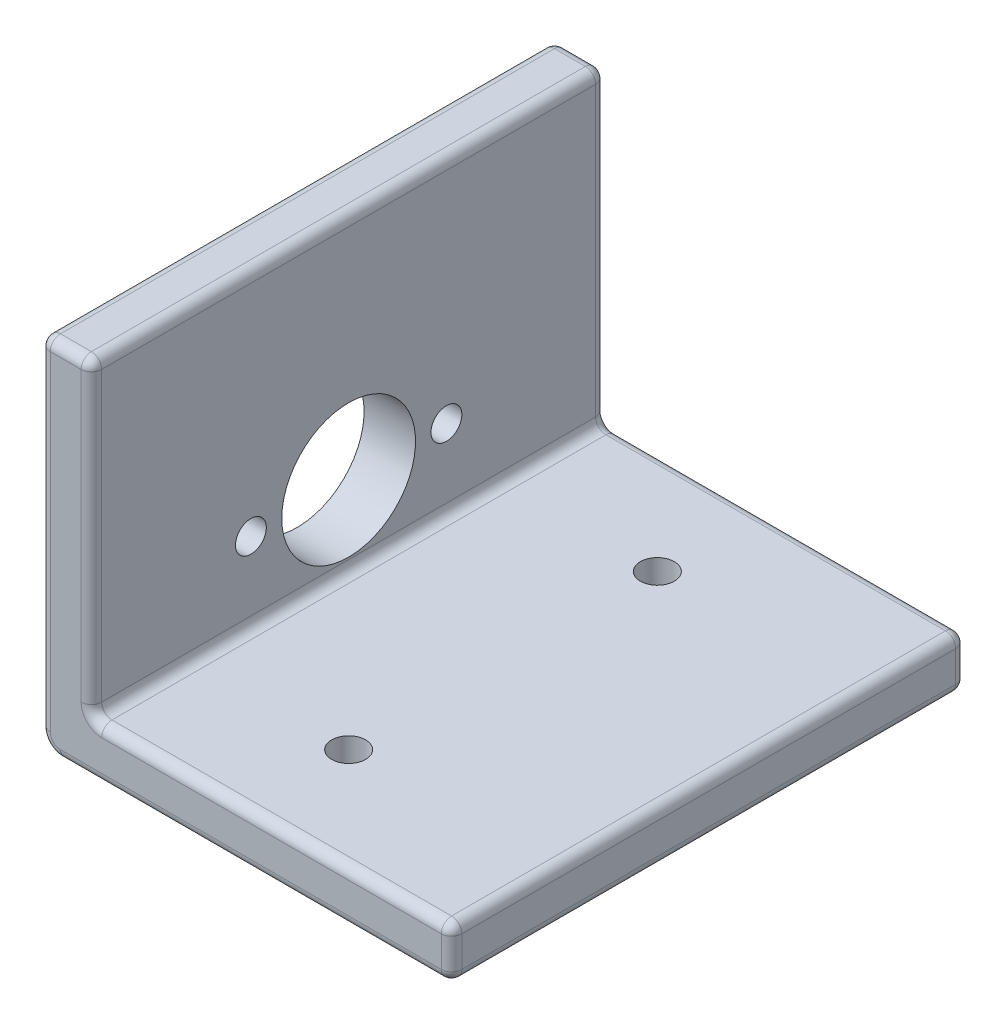
ISO-10303-21;
HEADER;
FILE_DESCRIPTION(('STEP AP214'),'2;1');
FILE_NAME('part.step','',(''),(''),'','','');
FILE_SCHEMA(('AUTOMOTIVE_DESIGN { 1 0 10303 214 1 1 1 1 }'));
ENDSEC;
DATA;
#1=APPLICATION_CONTEXT('core data for automotive mechanical design processes');
#2=APPLICATION_PROTOCOL_DEFINITION('international standard','automotive_design',2000,#1);
#3=PRODUCT_CONTEXT('',#1,'mechanical');
#4=PRODUCT('Part','Part','',(#3));
#5=PRODUCT_RELATED_PRODUCT_CATEGORY('part','',(#4));
#6=PRODUCT_DEFINITION_FORMATION('','',#4);
#7=PRODUCT_DEFINITION_CONTEXT('part definition',#1,'design');
#8=PRODUCT_DEFINITION('design','',#6,#7);
#9=PRODUCT_DEFINITION_SHAPE('','',#8);
#10=(LENGTH_UNIT() NAMED_UNIT(*) SI_UNIT(.MILLI.,.METRE.));
#11=(NAMED_UNIT(*) PLANE_ANGLE_UNIT() SI_UNIT($,.RADIAN.));
#12=(NAMED_UNIT(*) SI_UNIT($,.STERADIAN.) SOLID_ANGLE_UNIT());
#13=UNCERTAINTY_MEASURE_WITH_UNIT(LENGTH_MEASURE(1.E-05),#10,'distance_accuracy_value','');
#14=(GEOMETRIC_REPRESENTATION_CONTEXT(3) GLOBAL_UNCERTAINTY_ASSIGNED_CONTEXT((#13)) GLOBAL_UNIT_ASSIGNED_CONTEXT((#10,
#11,#12)) REPRESENTATION_CONTEXT('',''));
#15=CARTESIAN_POINT('',(0.,0.,0.));
#16=DIRECTION('',(0.,0.,1.));
#17=DIRECTION('',(1.,0.,0.));
#18=AXIS2_PLACEMENT_3D('',#15,#16,#17);
#19=CARTESIAN_POINT('',(0.,0.,50.));
#20=DIRECTION('',(0.,1.,0.));
#21=DIRECTION('',(0.,0.,1.));
#22=AXIS2_PLACEMENT_3D('',#19,#20,#21);
#23=PLANE('',#22);
#24=DIRECTION('',(0.,0.,-1.));
#25=VECTOR('',#24,1.);
#26=CARTESIAN_POINT('',(2.,0.,50.));
#27=LINE('',#26,#25);
#28=CARTESIAN_POINT('',(2.,0.,49.));
#29=VERTEX_POINT('',#28);
#30=CARTESIAN_POINT('',(2.,0.,1.));
#31=VERTEX_POINT('',#30);
#32=EDGE_CURVE('E176',#29,#31,#27,.T.);
#33=ORIENTED_EDGE('',*,*,#32,.T.);
#34=DIRECTION('',(1.,0.,0.));
#35=VECTOR('',#34,1.);
#36=CARTESIAN_POINT('',(0.,0.,1.));
#37=LINE('',#36,#35);
#38=CARTESIAN_POINT('',(39.,0.,1.));
#39=VERTEX_POINT('',#38);
#40=EDGE_CURVE('E184',#31,#39,#37,.T.);
#41=ORIENTED_EDGE('',*,*,#40,.T.);
#42=DIRECTION('',(0.,0.,-1.));
#43=VECTOR('',#42,1.);
#44=CARTESIAN_POINT('',(39.,0.,50.));
#45=LINE('',#44,#43);
#46=CARTESIAN_POINT('',(39.,0.,49.));
#47=VERTEX_POINT('',#46);
#48=EDGE_CURVE('E179',#39,#47,#45,.F.);
#49=ORIENTED_EDGE('',*,*,#48,.T.);
#50=DIRECTION('',(1.,0.,0.));
#51=VECTOR('',#50,1.);
#52=CARTESIAN_POINT('',(2.,0.,49.));
#53=LINE('',#52,#51);
#54=EDGE_CURVE('E172',#47,#29,#53,.F.);
#55=ORIENTED_EDGE('',*,*,#54,.T.);
#56=EDGE_LOOP('',(#33,#41,#49,#55));
#57=FACE_BOUND('',#56,.T.);
#58=CARTESIAN_POINT('',(20.,0.,10.));
#59=DIRECTION('',(0.,1.,0.));
#60=DIRECTION('',(0.,0.,1.));
#61=AXIS2_PLACEMENT_3D('',#58,#59,#60);
#62=CIRCLE('',#61,1.64999999999994);
#63=CARTESIAN_POINT('',(20.,0.,11.65));
#64=VERTEX_POINT('',#63);
#65=EDGE_CURVE('E274',#64,#64,#62,.T.);
#66=ORIENTED_EDGE('',*,*,#65,.T.);
#67=EDGE_LOOP('',(#66));
#68=FACE_BOUND('',#67,.T.);
#69=CARTESIAN_POINT('',(20.,0.,40.));
#70=DIRECTION('',(0.,1.,0.));
#71=DIRECTION('',(0.,0.,1.));
#72=AXIS2_PLACEMENT_3D('',#69,#70,#71);
#73=CIRCLE('',#72,1.64999999999994);
#74=CARTESIAN_POINT('',(20.,0.,41.6499999999999));
#75=VERTEX_POINT('',#74);
#76=EDGE_CURVE('E264',#75,#75,#73,.F.);
#77=ORIENTED_EDGE('',*,*,#76,.F.);
#78=EDGE_LOOP('',(#77));
#79=FACE_BOUND('',#78,.T.);
#80=ADVANCED_FACE('F32',(#57,#68,#79),#23,.F.);
#81=CARTESIAN_POINT('',(5.,5.,50.));
#82=DIRECTION('',(0.,-1.,0.));
#83=DIRECTION('',(0.,0.,-1.));
#84=AXIS2_PLACEMENT_3D('',#81,#82,#83);
#85=PLANE('',#84);
#86=DIRECTION('',(0.,0.,-1.));
#87=VECTOR('',#86,1.);
#88=CARTESIAN_POINT('',(39.,5.,50.));
#89=LINE('',#88,#87);
#90=CARTESIAN_POINT('',(39.,5.,49.));
#91=VERTEX_POINT('',#90);
#92=CARTESIAN_POINT('',(39.,5.,1.));
#93=VERTEX_POINT('',#92);
#94=EDGE_CURVE('E320',#91,#93,#89,.T.);
#95=ORIENTED_EDGE('',*,*,#94,.T.);
#96=DIRECTION('',(-1.,0.,0.));
#97=VECTOR('',#96,1.);
#98=CARTESIAN_POINT('',(5.,5.,1.));
#99=LINE('',#98,#97);
#100=CARTESIAN_POINT('',(6.,5.,1.));
#101=VERTEX_POINT('',#100);
#102=EDGE_CURVE('E324',#93,#101,#99,.T.);
#103=ORIENTED_EDGE('',*,*,#102,.T.);
#104=DIRECTION('',(0.,0.,-1.));
#105=VECTOR('',#104,1.);
#106=CARTESIAN_POINT('',(6.,5.,50.));
#107=LINE('',#106,#105);
#108=CARTESIAN_POINT('',(6.,5.,49.));
#109=VERTEX_POINT('',#108);
#110=EDGE_CURVE('E298',#101,#109,#107,.F.);
#111=ORIENTED_EDGE('',*,*,#110,.T.);
#112=DIRECTION('',(-1.,0.,0.));
#113=VECTOR('',#112,1.);
#114=CARTESIAN_POINT('',(40.,5.,49.));
#115=LINE('',#114,#113);
#116=EDGE_CURVE('E322',#109,#91,#115,.F.);
#117=ORIENTED_EDGE('',*,*,#116,.T.);
#118=EDGE_LOOP('',(#95,#103,#111,#117));
#119=FACE_BOUND('',#118,.T.);
#120=CARTESIAN_POINT('',(20.,5.,10.));
#121=DIRECTION('',(0.,1.,0.));
#122=DIRECTION('',(0.,0.,1.));
#123=AXIS2_PLACEMENT_3D('',#120,#121,#122);
#124=CIRCLE('',#123,1.64999999999994);
#125=CARTESIAN_POINT('',(20.,5.,11.65));
#126=VERTEX_POINT('',#125);
#127=EDGE_CURVE('E269',#126,#126,#124,.T.);
#128=ORIENTED_EDGE('',*,*,#127,.F.);
#129=EDGE_LOOP('',(#128));
#130=FACE_BOUND('',#129,.T.);
#131=CARTESIAN_POINT('',(20.,5.,40.));
#132=DIRECTION('',(0.,1.,0.));
#133=DIRECTION('',(0.,0.,1.));
#134=AXIS2_PLACEMENT_3D('',#131,#132,#133);
#135=CIRCLE('',#134,1.64999999999994);
#136=CARTESIAN_POINT('',(20.,5.,41.6499999999999));
#137=VERTEX_POINT('',#136);
#138=EDGE_CURVE('E258',#137,#137,#135,.F.);
#139=ORIENTED_EDGE('',*,*,#138,.T.);
#140=EDGE_LOOP('',(#139));
#141=FACE_BOUND('',#140,.T.);
#142=ADVANCED_FACE('F444',(#119,#130,#141),#85,.F.);
#143=CARTESIAN_POINT('',(40.,0.,50.));
#144=DIRECTION('',(-1.,0.,0.));
#145=DIRECTION('',(0.,0.,1.));
#146=AXIS2_PLACEMENT_3D('',#143,#144,#145);
#147=PLANE('',#146);
#148=DIRECTION('',(0.,0.,-1.));
#149=VECTOR('',#148,1.);
#150=CARTESIAN_POINT('',(40.,1.,50.));
#151=LINE('',#150,#149);
#152=CARTESIAN_POINT('',(40.,1.,49.));
#153=VERTEX_POINT('',#152);
#154=CARTESIAN_POINT('',(40.,1.,1.));
#155=VERTEX_POINT('',#154);
#156=EDGE_CURVE('E41',#153,#155,#151,.T.);
#157=ORIENTED_EDGE('',*,*,#156,.T.);
#158=DIRECTION('',(0.,1.,0.));
#159=VECTOR('',#158,1.);
#160=CARTESIAN_POINT('',(40.,0.,1.));
#161=LINE('',#160,#159);
#162=CARTESIAN_POINT('',(40.,4.,1.));
#163=VERTEX_POINT('',#162);
#164=EDGE_CURVE('E11',#155,#163,#161,.T.);
#165=ORIENTED_EDGE('',*,*,#164,.T.);
#166=DIRECTION('',(0.,0.,-1.));
#167=VECTOR('',#166,1.);
#168=CARTESIAN_POINT('',(40.,4.,50.));
#169=LINE('',#168,#167);
#170=CARTESIAN_POINT('',(40.,4.,49.));
#171=VERTEX_POINT('',#170);
#172=EDGE_CURVE('E369',#163,#171,#169,.F.);
#173=ORIENTED_EDGE('',*,*,#172,.T.);
#174=DIRECTION('',(0.,1.,0.));
#175=VECTOR('',#174,1.);
#176=CARTESIAN_POINT('',(40.,0.,49.));
#177=LINE('',#176,#175);
#178=EDGE_CURVE('E367',#171,#153,#177,.F.);
#179=ORIENTED_EDGE('',*,*,#178,.T.);
#180=EDGE_LOOP('',(#157,#165,#173,#179));
#181=FACE_BOUND('',#180,.T.);
#182=ADVANCED_FACE('F424',(#181),#147,.F.);
#183=CARTESIAN_POINT('',(5.,5.,50.));
#184=DIRECTION('',(-1.,0.,0.));
#185=DIRECTION('',(0.,0.,1.));
#186=AXIS2_PLACEMENT_3D('',#183,#184,#185);
#187=PLANE('',#186);
#188=DIRECTION('',(0.,0.,-1.));
#189=VECTOR('',#188,1.);
#190=CARTESIAN_POINT('',(5.,6.,0.));
#191=LINE('',#190,#189);
#192=CARTESIAN_POINT('',(5.,6.,49.));
#193=VERTEX_POINT('',#192);
#194=CARTESIAN_POINT('',(5.,6.,1.));
#195=VERTEX_POINT('',#194);
#196=EDGE_CURVE('E295',#193,#195,#191,.T.);
#197=ORIENTED_EDGE('',*,*,#196,.T.);
#198=DIRECTION('',(0.,1.,0.));
#199=VECTOR('',#198,1.);
#200=CARTESIAN_POINT('',(5.,5.,1.));
#201=LINE('',#200,#199);
#202=CARTESIAN_POINT('',(5.,34.,1.));
#203=VERTEX_POINT('',#202);
#204=EDGE_CURVE('E356',#195,#203,#201,.T.);
#205=ORIENTED_EDGE('',*,*,#204,.T.);
#206=DIRECTION('',(0.,0.,-1.));
#207=VECTOR('',#206,1.);
#208=CARTESIAN_POINT('',(5.,34.,50.));
#209=LINE('',#208,#207);
#210=CARTESIAN_POINT('',(5.,34.,49.));
#211=VERTEX_POINT('',#210);
#212=EDGE_CURVE('E352',#203,#211,#209,.F.);
#213=ORIENTED_EDGE('',*,*,#212,.T.);
#214=DIRECTION('',(0.,1.,0.));
#215=VECTOR('',#214,1.);
#216=CARTESIAN_POINT('',(5.,6.,49.));
#217=LINE('',#216,#215);
#218=EDGE_CURVE('E354',#211,#193,#217,.F.);
#219=ORIENTED_EDGE('',*,*,#218,.T.);
#220=EDGE_LOOP('',(#197,#205,#213,#219));
#221=FACE_BOUND('',#220,.T.);
#222=CARTESIAN_POINT('',(5.,12.7,34.5));
#223=DIRECTION('',(-1.,0.,0.));
#224=DIRECTION('',(0.,0.,1.));
#225=AXIS2_PLACEMENT_3D('',#222,#223,#224);
#226=CIRCLE('',#225,1.50000000000008);
#227=CARTESIAN_POINT('',(5.,12.7,36.0000000000001));
#228=VERTEX_POINT('',#227);
#229=EDGE_CURVE('E280',#228,#228,#226,.T.);
#230=ORIENTED_EDGE('',*,*,#229,.T.);
#231=EDGE_LOOP('',(#230));
#232=FACE_BOUND('',#231,.T.);
#233=CARTESIAN_POINT('',(5.,12.7,15.5));
#234=DIRECTION('',(-1.,0.,0.));
#235=DIRECTION('',(0.,0.,1.));
#236=AXIS2_PLACEMENT_3D('',#233,#234,#235);
#237=CIRCLE('',#236,1.50000000000008);
#238=CARTESIAN_POINT('',(5.,12.7,17.0000000000001));
#239=VERTEX_POINT('',#238);
#240=EDGE_CURVE('E286',#239,#239,#237,.T.);
#241=ORIENTED_EDGE('',*,*,#240,.T.);
#242=EDGE_LOOP('',(#241));
#243=FACE_BOUND('',#242,.T.);
#244=CARTESIAN_POINT('',(5.,12.7,25.));
#245=DIRECTION('',(-1.,0.,0.));
#246=DIRECTION('',(0.,0.,1.));
#247=AXIS2_PLACEMENT_3D('',#244,#245,#246);
#248=CIRCLE('',#247,6.4999999999999);
#249=CARTESIAN_POINT('',(5.,12.7,31.4999999999999));
#250=VERTEX_POINT('',#249);
#251=EDGE_CURVE('E195',#250,#250,#248,.T.);
#252=ORIENTED_EDGE('',*,*,#251,.T.);
#253=EDGE_LOOP('',(#252));
#254=FACE_BOUND('',#253,.T.);
#255=ADVANCED_FACE('F542',(#221,#232,#243,#254),#187,.F.);
#256=CARTESIAN_POINT('',(0.,35.,50.));
#257=DIRECTION('',(0.,-1.,0.));
#258=DIRECTION('',(0.,0.,-1.));
#259=AXIS2_PLACEMENT_3D('',#256,#257,#258);
#260=PLANE('',#259);
#261=DIRECTION('',(0.,0.,-1.));
#262=VECTOR('',#261,1.);
#263=CARTESIAN_POINT('',(1.,35.,50.));
#264=LINE('',#263,#262);
#265=CARTESIAN_POINT('',(1.,35.,1.));
#266=VERTEX_POINT('',#265);
#267=CARTESIAN_POINT('',(1.,35.,49.));
#268=VERTEX_POINT('',#267);
#269=EDGE_CURVE('E360',#266,#268,#264,.F.);
#270=ORIENTED_EDGE('',*,*,#269,.T.);
#271=DIRECTION('',(-1.,0.,0.));
#272=VECTOR('',#271,1.);
#273=CARTESIAN_POINT('',(5.,35.,49.));
#274=LINE('',#273,#272);
#275=CARTESIAN_POINT('',(4.,35.,49.));
#276=VERTEX_POINT('',#275);
#277=EDGE_CURVE('E365',#268,#276,#274,.F.);
#278=ORIENTED_EDGE('',*,*,#277,.T.);
#279=DIRECTION('',(0.,0.,-1.));
#280=VECTOR('',#279,1.);
#281=CARTESIAN_POINT('',(4.,35.,50.));
#282=LINE('',#281,#280);
#283=CARTESIAN_POINT('',(4.,35.,1.));
#284=VERTEX_POINT('',#283);
#285=EDGE_CURVE('E362',#276,#284,#282,.T.);
#286=ORIENTED_EDGE('',*,*,#285,.T.);
#287=DIRECTION('',(-1.,0.,0.));
#288=VECTOR('',#287,1.);
#289=CARTESIAN_POINT('',(0.,35.,1.));
#290=LINE('',#289,#288);
#291=EDGE_CURVE('E358',#284,#266,#290,.T.);
#292=ORIENTED_EDGE('',*,*,#291,.T.);
#293=EDGE_LOOP('',(#270,#278,#286,#292));
#294=FACE_BOUND('',#293,.T.);
#295=ADVANCED_FACE('F538',(#294),#260,.F.);
#296=CARTESIAN_POINT('',(0.,0.,50.));
#297=DIRECTION('',(1.,0.,0.));
#298=DIRECTION('',(0.,0.,-1.));
#299=AXIS2_PLACEMENT_3D('',#296,#297,#298);
#300=PLANE('',#299);
#301=CARTESIAN_POINT('',(0.,12.7,34.5));
#302=DIRECTION('',(-1.,0.,0.));
#303=DIRECTION('',(0.,0.,1.));
#304=AXIS2_PLACEMENT_3D('',#301,#302,#303);
#305=CIRCLE('',#304,1.50000000000008);
#306=CARTESIAN_POINT('',(0.,12.7,36.0000000000001));
#307=VERTEX_POINT('',#306);
#308=EDGE_CURVE('E277',#307,#307,#305,.T.);
#309=ORIENTED_EDGE('',*,*,#308,.F.);
#310=EDGE_LOOP('',(#309));
#311=FACE_BOUND('',#310,.T.);
#312=CARTESIAN_POINT('',(0.,12.7,15.5));
#313=DIRECTION('',(-1.,0.,0.));
#314=DIRECTION('',(0.,0.,1.));
#315=AXIS2_PLACEMENT_3D('',#312,#313,#314);
#316=CIRCLE('',#315,1.50000000000008);
#317=CARTESIAN_POINT('',(0.,12.7,17.0000000000001));
#318=VERTEX_POINT('',#317);
#319=EDGE_CURVE('E283',#318,#318,#316,.T.);
#320=ORIENTED_EDGE('',*,*,#319,.F.);
#321=EDGE_LOOP('',(#320));
#322=FACE_BOUND('',#321,.T.);
#323=CARTESIAN_POINT('',(0.,12.7,25.));
#324=DIRECTION('',(-1.,0.,0.));
#325=DIRECTION('',(0.,0.,1.));
#326=AXIS2_PLACEMENT_3D('',#323,#324,#325);
#327=CIRCLE('',#326,6.4999999999999);
#328=CARTESIAN_POINT('',(0.,12.7,31.4999999999999));
#329=VERTEX_POINT('',#328);
#330=EDGE_CURVE('E289',#329,#329,#327,.T.);
#331=ORIENTED_EDGE('',*,*,#330,.F.);
#332=EDGE_LOOP('',(#331));
#333=FACE_BOUND('',#332,.T.);
#334=DIRECTION('',(0.,0.,-1.));
#335=VECTOR('',#334,1.);
#336=CARTESIAN_POINT('',(0.,34.,50.));
#337=LINE('',#336,#335);
#338=CARTESIAN_POINT('',(0.,34.,49.));
#339=VERTEX_POINT('',#338);
#340=CARTESIAN_POINT('',(0.,34.,1.));
#341=VERTEX_POINT('',#340);
#342=EDGE_CURVE('E346',#339,#341,#337,.T.);
#343=ORIENTED_EDGE('',*,*,#342,.T.);
#344=DIRECTION('',(0.,-1.,0.));
#345=VECTOR('',#344,1.);
#346=CARTESIAN_POINT('',(0.,0.,1.));
#347=LINE('',#346,#345);
#348=CARTESIAN_POINT('',(0.,2.,1.));
#349=VERTEX_POINT('',#348);
#350=EDGE_CURVE('E350',#341,#349,#347,.T.);
#351=ORIENTED_EDGE('',*,*,#350,.T.);
#352=DIRECTION('',(0.,0.,-1.));
#353=VECTOR('',#352,1.);
#354=CARTESIAN_POINT('',(0.,2.,50.));
#355=LINE('',#354,#353);
#356=CARTESIAN_POINT('',(0.,2.,49.));
#357=VERTEX_POINT('',#356);
#358=EDGE_CURVE('E194',#349,#357,#355,.F.);
#359=ORIENTED_EDGE('',*,*,#358,.T.);
#360=DIRECTION('',(0.,-1.,0.));
#361=VECTOR('',#360,1.);
#362=CARTESIAN_POINT('',(0.,35.,49.));
#363=LINE('',#362,#361);
#364=EDGE_CURVE('E348',#357,#339,#363,.F.);
#365=ORIENTED_EDGE('',*,*,#364,.T.);
#366=EDGE_LOOP('',(#343,#351,#359,#365));
#367=FACE_BOUND('',#366,.T.);
#368=ADVANCED_FACE('F467',(#311,#322,#333,#367),#300,.F.);
#369=CARTESIAN_POINT('',(40.,0.,50.));
#370=DIRECTION('',(0.,0.,1.));
#371=DIRECTION('',(1.,0.,0.));
#372=AXIS2_PLACEMENT_3D('',#369,#370,#371);
#373=PLANE('',#372);
#374=DIRECTION('',(1.,0.,0.));
#375=VECTOR('',#374,1.);
#376=CARTESIAN_POINT('',(40.,1.,50.));
#377=LINE('',#376,#375);
#378=CARTESIAN_POINT('',(2.,1.,50.));
#379=VERTEX_POINT('',#378);
#380=CARTESIAN_POINT('',(39.,1.,50.));
#381=VERTEX_POINT('',#380);
#382=EDGE_CURVE('E210',#379,#381,#377,.T.);
#383=ORIENTED_EDGE('',*,*,#382,.T.);
#384=DIRECTION('',(0.,1.,0.));
#385=VECTOR('',#384,1.);
#386=CARTESIAN_POINT('',(39.,5.,50.));
#387=LINE('',#386,#385);
#388=CARTESIAN_POINT('',(39.,4.,50.));
#389=VERTEX_POINT('',#388);
#390=EDGE_CURVE('E344',#381,#389,#387,.T.);
#391=ORIENTED_EDGE('',*,*,#390,.T.);
#392=DIRECTION('',(-1.,0.,0.));
#393=VECTOR('',#392,1.);
#394=CARTESIAN_POINT('',(6.,4.,50.));
#395=LINE('',#394,#393);
#396=CARTESIAN_POINT('',(6.,4.,50.));
#397=VERTEX_POINT('',#396);
#398=EDGE_CURVE('E339',#389,#397,#395,.T.);
#399=ORIENTED_EDGE('',*,*,#398,.T.);
#400=CARTESIAN_POINT('',(6.,6.,50.));
#401=DIRECTION('',(0.,0.,1.));
#402=DIRECTION('',(1.,0.,0.));
#403=AXIS2_PLACEMENT_3D('',#400,#401,#402);
#404=CIRCLE('',#403,2.);
#405=CARTESIAN_POINT('',(4.,6.,50.));
#406=VERTEX_POINT('',#405);
#407=EDGE_CURVE('E337',#397,#406,#404,.F.);
#408=ORIENTED_EDGE('',*,*,#407,.T.);
#409=DIRECTION('',(0.,1.,0.));
#410=VECTOR('',#409,1.);
#411=CARTESIAN_POINT('',(4.,35.,50.));
#412=LINE('',#411,#410);
#413=CARTESIAN_POINT('',(4.,34.,50.));
#414=VERTEX_POINT('',#413);
#415=EDGE_CURVE('E333',#406,#414,#412,.T.);
#416=ORIENTED_EDGE('',*,*,#415,.T.);
#417=DIRECTION('',(-1.,0.,0.));
#418=VECTOR('',#417,1.);
#419=CARTESIAN_POINT('',(0.,34.,50.));
#420=LINE('',#419,#418);
#421=CARTESIAN_POINT('',(1.,34.,50.));
#422=VERTEX_POINT('',#421);
#423=EDGE_CURVE('E331',#414,#422,#420,.T.);
#424=ORIENTED_EDGE('',*,*,#423,.T.);
#425=DIRECTION('',(0.,-1.,0.));
#426=VECTOR('',#425,1.);
#427=CARTESIAN_POINT('',(1.,2.,50.));
#428=LINE('',#427,#426);
#429=CARTESIAN_POINT('',(1.,2.,50.));
#430=VERTEX_POINT('',#429);
#431=EDGE_CURVE('E335',#422,#430,#428,.T.);
#432=ORIENTED_EDGE('',*,*,#431,.T.);
#433=CARTESIAN_POINT('',(2.,2.,50.));
#434=DIRECTION('',(0.,0.,1.));
#435=DIRECTION('',(1.,0.,0.));
#436=AXIS2_PLACEMENT_3D('',#433,#434,#435);
#437=CIRCLE('',#436,1.);
#438=EDGE_CURVE('E341',#430,#379,#437,.T.);
#439=ORIENTED_EDGE('',*,*,#438,.T.);
#440=EDGE_LOOP('',(#383,#391,#399,#408,#416,#424,#432,#439));
#441=FACE_BOUND('',#440,.T.);
#442=ADVANCED_FACE('F456',(#441),#373,.T.);
#443=CARTESIAN_POINT('',(40.,0.,0.));
#444=DIRECTION('',(0.,0.,1.));
#445=DIRECTION('',(1.,0.,0.));
#446=AXIS2_PLACEMENT_3D('',#443,#444,#445);
#447=PLANE('',#446);
#448=DIRECTION('',(-1.,0.,0.));
#449=VECTOR('',#448,1.);
#450=CARTESIAN_POINT('',(40.,4.,0.));
#451=LINE('',#450,#449);
#452=CARTESIAN_POINT('',(6.,4.,0.));
#453=VERTEX_POINT('',#452);
#454=CARTESIAN_POINT('',(39.,4.,0.));
#455=VERTEX_POINT('',#454);
#456=EDGE_CURVE('E311',#453,#455,#451,.F.);
#457=ORIENTED_EDGE('',*,*,#456,.T.);
#458=DIRECTION('',(0.,1.,0.));
#459=VECTOR('',#458,1.);
#460=CARTESIAN_POINT('',(39.,0.,0.));
#461=LINE('',#460,#459);
#462=CARTESIAN_POINT('',(39.,1.,0.));
#463=VERTEX_POINT('',#462);
#464=EDGE_CURVE('E206',#455,#463,#461,.F.);
#465=ORIENTED_EDGE('',*,*,#464,.T.);
#466=DIRECTION('',(1.,0.,0.));
#467=VECTOR('',#466,1.);
#468=CARTESIAN_POINT('',(40.,1.,0.));
#469=LINE('',#468,#467);
#470=CARTESIAN_POINT('',(2.,1.,0.));
#471=VERTEX_POINT('',#470);
#472=EDGE_CURVE('E315',#463,#471,#469,.F.);
#473=ORIENTED_EDGE('',*,*,#472,.T.);
#474=CARTESIAN_POINT('',(2.,2.,0.));
#475=DIRECTION('',(0.,0.,1.));
#476=DIRECTION('',(1.,0.,0.));
#477=AXIS2_PLACEMENT_3D('',#474,#475,#476);
#478=CIRCLE('',#477,1.);
#479=CARTESIAN_POINT('',(1.,2.,0.));
#480=VERTEX_POINT('',#479);
#481=EDGE_CURVE('E313',#471,#480,#478,.F.);
#482=ORIENTED_EDGE('',*,*,#481,.T.);
#483=DIRECTION('',(0.,-1.,0.));
#484=VECTOR('',#483,1.);
#485=CARTESIAN_POINT('',(1.,0.,0.));
#486=LINE('',#485,#484);
#487=CARTESIAN_POINT('',(1.,34.,0.));
#488=VERTEX_POINT('',#487);
#489=EDGE_CURVE('E307',#480,#488,#486,.F.);
#490=ORIENTED_EDGE('',*,*,#489,.T.);
#491=DIRECTION('',(-1.,0.,0.));
#492=VECTOR('',#491,1.);
#493=CARTESIAN_POINT('',(40.,34.,0.));
#494=LINE('',#493,#492);
#495=CARTESIAN_POINT('',(4.,34.,0.));
#496=VERTEX_POINT('',#495);
#497=EDGE_CURVE('E303',#488,#496,#494,.F.);
#498=ORIENTED_EDGE('',*,*,#497,.T.);
#499=DIRECTION('',(0.,1.,0.));
#500=VECTOR('',#499,1.);
#501=CARTESIAN_POINT('',(4.,0.,0.));
#502=LINE('',#501,#500);
#503=CARTESIAN_POINT('',(4.,6.,0.));
#504=VERTEX_POINT('',#503);
#505=EDGE_CURVE('E305',#496,#504,#502,.F.);
#506=ORIENTED_EDGE('',*,*,#505,.T.);
#507=CARTESIAN_POINT('',(6.,6.,0.));
#508=DIRECTION('',(0.,0.,1.));
#509=DIRECTION('',(1.,0.,0.));
#510=AXIS2_PLACEMENT_3D('',#507,#508,#509);
#511=CIRCLE('',#510,2.);
#512=EDGE_CURVE('E309',#504,#453,#511,.T.);
#513=ORIENTED_EDGE('',*,*,#512,.T.);
#514=EDGE_LOOP('',(#457,#465,#473,#482,#490,#498,#506,#513));
#515=FACE_BOUND('',#514,.T.);
#516=ADVANCED_FACE('F501',(#515),#447,.F.);
#517=CARTESIAN_POINT('',(2.,2.,50.));
#518=DIRECTION('',(0.,0.,-1.));
#519=DIRECTION('',(-1.,0.,0.));
#520=AXIS2_PLACEMENT_3D('',#517,#518,#519);
#521=CYLINDRICAL_SURFACE('',#520,2.);
#522=ORIENTED_EDGE('',*,*,#358,.F.);
#523=CARTESIAN_POINT('',(2.,2.,1.));
#524=DIRECTION('',(0.,0.,1.));
#525=DIRECTION('',(1.,0.,0.));
#526=AXIS2_PLACEMENT_3D('',#523,#524,#525);
#527=CIRCLE('',#526,2.);
#528=EDGE_CURVE('E193',#349,#31,#527,.T.);
#529=ORIENTED_EDGE('',*,*,#528,.T.);
#530=ORIENTED_EDGE('',*,*,#32,.F.);
#531=CARTESIAN_POINT('',(2.,2.,49.));
#532=DIRECTION('',(0.,0.,1.));
#533=DIRECTION('',(1.,0.,0.));
#534=AXIS2_PLACEMENT_3D('',#531,#532,#533);
#535=CIRCLE('',#534,2.);
#536=EDGE_CURVE('E190',#29,#357,#535,.F.);
#537=ORIENTED_EDGE('',*,*,#536,.T.);
#538=EDGE_LOOP('',(#522,#529,#530,#537));
#539=FACE_BOUND('',#538,.T.);
#540=ADVANCED_FACE('F189',(#539),#521,.T.);
#541=CARTESIAN_POINT('',(20.,12.7,25.));
#542=DIRECTION('',(-1.,0.,0.));
#543=DIRECTION('',(0.,0.,1.));
#544=AXIS2_PLACEMENT_3D('',#541,#542,#543);
#545=CYLINDRICAL_SURFACE('',#544,6.4999999999999);
#546=ORIENTED_EDGE('',*,*,#330,.T.);
#547=EDGE_LOOP('',(#546));
#548=FACE_BOUND('',#547,.T.);
#549=ORIENTED_EDGE('',*,*,#251,.F.);
#550=EDGE_LOOP('',(#549));
#551=FACE_BOUND('',#550,.T.);
#552=ADVANCED_FACE('F500',(#548,#551),#545,.F.);
#553=CARTESIAN_POINT('',(20.,12.7,15.5));
#554=DIRECTION('',(-1.,0.,0.));
#555=DIRECTION('',(0.,0.,1.));
#556=AXIS2_PLACEMENT_3D('',#553,#554,#555);
#557=CYLINDRICAL_SURFACE('',#556,1.50000000000008);
#558=ORIENTED_EDGE('',*,*,#319,.T.);
#559=EDGE_LOOP('',(#558));
#560=FACE_BOUND('',#559,.T.);
#561=ORIENTED_EDGE('',*,*,#240,.F.);
#562=EDGE_LOOP('',(#561));
#563=FACE_BOUND('',#562,.T.);
#564=ADVANCED_FACE('F523',(#560,#563),#557,.F.);
#565=CARTESIAN_POINT('',(20.,12.7,34.5));
#566=DIRECTION('',(-1.,0.,0.));
#567=DIRECTION('',(0.,0.,1.));
#568=AXIS2_PLACEMENT_3D('',#565,#566,#567);
#569=CYLINDRICAL_SURFACE('',#568,1.50000000000008);
#570=ORIENTED_EDGE('',*,*,#308,.T.);
#571=EDGE_LOOP('',(#570));
#572=FACE_BOUND('',#571,.T.);
#573=ORIENTED_EDGE('',*,*,#229,.F.);
#574=EDGE_LOOP('',(#573));
#575=FACE_BOUND('',#574,.T.);
#576=ADVANCED_FACE('F516',(#572,#575),#569,.F.);
#577=CARTESIAN_POINT('',(20.,-15.,10.));
#578=DIRECTION('',(0.,1.,0.));
#579=DIRECTION('',(0.,0.,1.));
#580=AXIS2_PLACEMENT_3D('',#577,#578,#579);
#581=CYLINDRICAL_SURFACE('',#580,1.64999999999994);
#582=ORIENTED_EDGE('',*,*,#127,.T.);
#583=EDGE_LOOP('',(#582));
#584=FACE_BOUND('',#583,.T.);
#585=ORIENTED_EDGE('',*,*,#65,.F.);
#586=EDGE_LOOP('',(#585));
#587=FACE_BOUND('',#586,.T.);
#588=ADVANCED_FACE('F510',(#584,#587),#581,.F.);
#589=CARTESIAN_POINT('',(20.,-15.,40.));
#590=DIRECTION('',(0.,1.,0.));
#591=DIRECTION('',(0.,0.,1.));
#592=AXIS2_PLACEMENT_3D('',#589,#590,#591);
#593=CYLINDRICAL_SURFACE('',#592,1.64999999999994);
#594=ORIENTED_EDGE('',*,*,#138,.F.);
#595=EDGE_LOOP('',(#594));
#596=FACE_BOUND('',#595,.T.);
#597=ORIENTED_EDGE('',*,*,#76,.T.);
#598=EDGE_LOOP('',(#597));
#599=FACE_BOUND('',#598,.T.);
#600=ADVANCED_FACE('F503',(#596,#599),#593,.F.);
#601=CARTESIAN_POINT('',(6.,6.,50.));
#602=DIRECTION('',(0.,0.,1.));
#603=DIRECTION('',(1.,0.,0.));
#604=AXIS2_PLACEMENT_3D('',#601,#602,#603);
#605=CYLINDRICAL_SURFACE('',#604,1.);
#606=ORIENTED_EDGE('',*,*,#110,.F.);
#607=CARTESIAN_POINT('',(6.,6.,1.));
#608=DIRECTION('',(0.,0.,1.));
#609=DIRECTION('',(1.,0.,0.));
#610=AXIS2_PLACEMENT_3D('',#607,#608,#609);
#611=CIRCLE('',#610,1.);
#612=EDGE_CURVE('E329',#101,#195,#611,.F.);
#613=ORIENTED_EDGE('',*,*,#612,.T.);
#614=ORIENTED_EDGE('',*,*,#196,.F.);
#615=CARTESIAN_POINT('',(6.,6.,49.));
#616=DIRECTION('',(0.,0.,1.));
#617=DIRECTION('',(1.,0.,0.));
#618=AXIS2_PLACEMENT_3D('',#615,#616,#617);
#619=CIRCLE('',#618,1.);
#620=EDGE_CURVE('E327',#193,#109,#619,.T.);
#621=ORIENTED_EDGE('',*,*,#620,.T.);
#622=EDGE_LOOP('',(#606,#613,#614,#621));
#623=FACE_BOUND('',#622,.T.);
#624=ADVANCED_FACE('F448',(#623),#605,.F.);
#625=CARTESIAN_POINT('',(4.,0.,49.));
#626=DIRECTION('',(0.,-1.,0.));
#627=DIRECTION('',(0.,0.,-1.));
#628=AXIS2_PLACEMENT_3D('',#625,#626,#627);
#629=CYLINDRICAL_SURFACE('',#628,1.);
#630=CARTESIAN_POINT('',(4.,34.,49.));
#631=DIRECTION('',(0.,1.,0.));
#632=DIRECTION('',(0.,0.,1.));
#633=AXIS2_PLACEMENT_3D('',#630,#631,#632);
#634=CIRCLE('',#633,1.);
#635=EDGE_CURVE('E36',#414,#211,#634,.T.);
#636=ORIENTED_EDGE('',*,*,#635,.F.);
#637=ORIENTED_EDGE('',*,*,#415,.F.);
#638=CARTESIAN_POINT('',(4.,6.,49.));
#639=DIRECTION('',(0.,-1.,0.));
#640=DIRECTION('',(0.,0.,-1.));
#641=AXIS2_PLACEMENT_3D('',#638,#639,#640);
#642=CIRCLE('',#641,1.);
#643=EDGE_CURVE('E251',#193,#406,#642,.T.);
#644=ORIENTED_EDGE('',*,*,#643,.F.);
#645=ORIENTED_EDGE('',*,*,#218,.F.);
#646=EDGE_LOOP('',(#636,#637,#644,#645));
#647=FACE_BOUND('',#646,.T.);
#648=ADVANCED_FACE('F34',(#647),#629,.T.);
#649=CARTESIAN_POINT('',(4.,34.,49.));
#650=DIRECTION('',(0.,0.,1.));
#651=DIRECTION('',(1.,0.,0.));
#652=AXIS2_PLACEMENT_3D('',#649,#650,#651);
#653=SPHERICAL_SURFACE('',#652,1.);
#654=CARTESIAN_POINT('',(4.,34.,49.));
#655=DIRECTION('',(1.,0.,0.));
#656=DIRECTION('',(0.,0.,-1.));
#657=AXIS2_PLACEMENT_3D('',#654,#655,#656);
#658=CIRCLE('',#657,1.);
#659=EDGE_CURVE('E246',#414,#276,#658,.F.);
#660=ORIENTED_EDGE('',*,*,#659,.F.);
#661=ORIENTED_EDGE('',*,*,#635,.T.);
#662=CARTESIAN_POINT('',(4.,34.,49.));
#663=DIRECTION('',(0.,0.,1.));
#664=DIRECTION('',(1.,0.,0.));
#665=AXIS2_PLACEMENT_3D('',#662,#663,#664);
#666=CIRCLE('',#665,1.);
#667=EDGE_CURVE('E249',#276,#211,#666,.F.);
#668=ORIENTED_EDGE('',*,*,#667,.F.);
#669=EDGE_LOOP('',(#660,#661,#668));
#670=FACE_BOUND('',#669,.T.);
#671=ADVANCED_FACE('F508',(#670),#653,.T.);
#672=CARTESIAN_POINT('',(6.,6.,49.));
#673=DIRECTION('',(0.,0.,1.));
#674=DIRECTION('',(1.,0.,0.));
#675=AXIS2_PLACEMENT_3D('',#672,#673,#674);
#676=TOROIDAL_SURFACE('',#675,2.,1.);
#677=ORIENTED_EDGE('',*,*,#643,.T.);
#678=ORIENTED_EDGE('',*,*,#407,.F.);
#679=CARTESIAN_POINT('',(6.,4.,49.));
#680=DIRECTION('',(1.,0.,0.));
#681=DIRECTION('',(0.,0.,-1.));
#682=AXIS2_PLACEMENT_3D('',#679,#680,#681);
#683=CIRCLE('',#682,1.);
#684=EDGE_CURVE('E243',#109,#397,#683,.T.);
#685=ORIENTED_EDGE('',*,*,#684,.F.);
#686=ORIENTED_EDGE('',*,*,#620,.F.);
#687=EDGE_LOOP('',(#677,#678,#685,#686));
#688=FACE_BOUND('',#687,.T.);
#689=ADVANCED_FACE('F450',(#688),#676,.T.);
#690=CARTESIAN_POINT('',(4.,34.,50.));
#691=DIRECTION('',(0.,0.,-1.));
#692=DIRECTION('',(-1.,0.,0.));
#693=AXIS2_PLACEMENT_3D('',#690,#691,#692);
#694=CYLINDRICAL_SURFACE('',#693,1.);
#695=ORIENTED_EDGE('',*,*,#667,.T.);
#696=ORIENTED_EDGE('',*,*,#212,.F.);
#697=CARTESIAN_POINT('',(4.,34.,1.));
#698=DIRECTION('',(0.,0.,-1.));
#699=DIRECTION('',(-1.,0.,0.));
#700=AXIS2_PLACEMENT_3D('',#697,#698,#699);
#701=CIRCLE('',#700,1.);
#702=EDGE_CURVE('E237',#284,#203,#701,.T.);
#703=ORIENTED_EDGE('',*,*,#702,.F.);
#704=ORIENTED_EDGE('',*,*,#285,.F.);
#705=EDGE_LOOP('',(#695,#696,#703,#704));
#706=FACE_BOUND('',#705,.T.);
#707=ADVANCED_FACE('F588',(#706),#694,.T.);
#708=CARTESIAN_POINT('',(40.,34.,49.));
#709=DIRECTION('',(1.,0.,0.));
#710=DIRECTION('',(0.,0.,-1.));
#711=AXIS2_PLACEMENT_3D('',#708,#709,#710);
#712=CYLINDRICAL_SURFACE('',#711,1.);
#713=ORIENTED_EDGE('',*,*,#659,.T.);
#714=ORIENTED_EDGE('',*,*,#277,.F.);
#715=CARTESIAN_POINT('',(1.,34.,49.));
#716=DIRECTION('',(-1.,0.,0.));
#717=DIRECTION('',(0.,-1.,0.));
#718=AXIS2_PLACEMENT_3D('',#715,#716,#717);
#719=CIRCLE('',#718,1.);
#720=EDGE_CURVE('E234',#422,#268,#719,.T.);
#721=ORIENTED_EDGE('',*,*,#720,.F.);
#722=ORIENTED_EDGE('',*,*,#423,.F.);
#723=EDGE_LOOP('',(#713,#714,#721,#722));
#724=FACE_BOUND('',#723,.T.);
#725=ADVANCED_FACE('F586',(#724),#712,.T.);
#726=CARTESIAN_POINT('',(1.,0.,49.));
#727=DIRECTION('',(0.,1.,0.));
#728=DIRECTION('',(0.,0.,1.));
#729=AXIS2_PLACEMENT_3D('',#726,#727,#728);
#730=CYLINDRICAL_SURFACE('',#729,1.);
#731=CARTESIAN_POINT('',(1.,2.,49.));
#732=DIRECTION('',(0.,-1.,0.));
#733=DIRECTION('',(0.,0.,-1.));
#734=AXIS2_PLACEMENT_3D('',#731,#732,#733);
#735=CIRCLE('',#734,1.);
#736=EDGE_CURVE('E205',#430,#357,#735,.T.);
#737=ORIENTED_EDGE('',*,*,#736,.F.);
#738=ORIENTED_EDGE('',*,*,#431,.F.);
#739=CARTESIAN_POINT('',(1.,34.,49.));
#740=DIRECTION('',(0.,1.,0.));
#741=DIRECTION('',(0.,0.,1.));
#742=AXIS2_PLACEMENT_3D('',#739,#740,#741);
#743=CIRCLE('',#742,1.);
#744=EDGE_CURVE('E231',#339,#422,#743,.T.);
#745=ORIENTED_EDGE('',*,*,#744,.F.);
#746=ORIENTED_EDGE('',*,*,#364,.F.);
#747=EDGE_LOOP('',(#737,#738,#745,#746));
#748=FACE_BOUND('',#747,.T.);
#749=ADVANCED_FACE('F464',(#748),#730,.T.);
#750=CARTESIAN_POINT('',(40.,4.,49.));
#751=DIRECTION('',(1.,0.,0.));
#752=DIRECTION('',(0.,0.,-1.));
#753=AXIS2_PLACEMENT_3D('',#750,#751,#752);
#754=CYLINDRICAL_SURFACE('',#753,1.);
#755=ORIENTED_EDGE('',*,*,#684,.T.);
#756=ORIENTED_EDGE('',*,*,#398,.F.);
#757=CARTESIAN_POINT('',(39.,4.,49.));
#758=DIRECTION('',(1.,0.,0.));
#759=DIRECTION('',(0.,0.,-1.));
#760=AXIS2_PLACEMENT_3D('',#757,#758,#759);
#761=CIRCLE('',#760,1.);
#762=EDGE_CURVE('E227',#91,#389,#761,.T.);
#763=ORIENTED_EDGE('',*,*,#762,.F.);
#764=ORIENTED_EDGE('',*,*,#116,.F.);
#765=EDGE_LOOP('',(#755,#756,#763,#764));
#766=FACE_BOUND('',#765,.T.);
#767=ADVANCED_FACE('F454',(#766),#754,.T.);
#768=CARTESIAN_POINT('',(4.,5.,1.));
#769=DIRECTION('',(0.,1.,0.));
#770=DIRECTION('',(0.,0.,1.));
#771=AXIS2_PLACEMENT_3D('',#768,#769,#770);
#772=CYLINDRICAL_SURFACE('',#771,1.);
#773=CARTESIAN_POINT('',(4.,34.,1.));
#774=DIRECTION('',(0.,1.,0.));
#775=DIRECTION('',(0.,0.,1.));
#776=AXIS2_PLACEMENT_3D('',#773,#774,#775);
#777=CIRCLE('',#776,1.);
#778=EDGE_CURVE('E240',#203,#496,#777,.T.);
#779=ORIENTED_EDGE('',*,*,#778,.F.);
#780=ORIENTED_EDGE('',*,*,#204,.F.);
#781=CARTESIAN_POINT('',(4.,6.,1.));
#782=DIRECTION('',(0.,-1.,0.));
#783=DIRECTION('',(0.,0.,-1.));
#784=AXIS2_PLACEMENT_3D('',#781,#782,#783);
#785=CIRCLE('',#784,1.);
#786=EDGE_CURVE('E224',#504,#195,#785,.T.);
#787=ORIENTED_EDGE('',*,*,#786,.F.);
#788=ORIENTED_EDGE('',*,*,#505,.F.);
#789=EDGE_LOOP('',(#779,#780,#787,#788));
#790=FACE_BOUND('',#789,.T.);
#791=ADVANCED_FACE('F564',(#790),#772,.T.);
#792=CARTESIAN_POINT('',(4.,34.,1.));
#793=DIRECTION('',(0.,0.,1.));
#794=DIRECTION('',(1.,0.,0.));
#795=AXIS2_PLACEMENT_3D('',#792,#793,#794);
#796=SPHERICAL_SURFACE('',#795,1.);
#797=ORIENTED_EDGE('',*,*,#702,.T.);
#798=ORIENTED_EDGE('',*,*,#778,.T.);
#799=CARTESIAN_POINT('',(4.,34.,1.));
#800=DIRECTION('',(1.,0.,0.));
#801=DIRECTION('',(0.,0.,-1.));
#802=AXIS2_PLACEMENT_3D('',#799,#800,#801);
#803=CIRCLE('',#802,1.);
#804=EDGE_CURVE('E215',#284,#496,#803,.F.);
#805=ORIENTED_EDGE('',*,*,#804,.F.);
#806=EDGE_LOOP('',(#797,#798,#805));
#807=FACE_BOUND('',#806,.T.);
#808=ADVANCED_FACE('F572',(#807),#796,.T.);
#809=CARTESIAN_POINT('',(1.,34.,49.));
#810=DIRECTION('',(0.,0.,1.));
#811=DIRECTION('',(1.,0.,0.));
#812=AXIS2_PLACEMENT_3D('',#809,#810,#811);
#813=SPHERICAL_SURFACE('',#812,1.);
#814=ORIENTED_EDGE('',*,*,#744,.T.);
#815=ORIENTED_EDGE('',*,*,#720,.T.);
#816=CARTESIAN_POINT('',(1.,34.,49.));
#817=DIRECTION('',(0.,0.,1.));
#818=DIRECTION('',(1.,0.,0.));
#819=AXIS2_PLACEMENT_3D('',#816,#817,#818);
#820=CIRCLE('',#819,1.);
#821=EDGE_CURVE('E211',#339,#268,#820,.F.);
#822=ORIENTED_EDGE('',*,*,#821,.F.);
#823=EDGE_LOOP('',(#814,#815,#822));
#824=FACE_BOUND('',#823,.T.);
#825=ADVANCED_FACE('F584',(#824),#813,.T.);
#826=CARTESIAN_POINT('',(2.,2.,49.));
#827=DIRECTION('',(0.,0.,1.));
#828=DIRECTION('',(1.,0.,0.));
#829=AXIS2_PLACEMENT_3D('',#826,#827,#828);
#830=DEGENERATE_TOROIDAL_SURFACE('',#829,1.,1.,.T.);
#831=ORIENTED_EDGE('',*,*,#736,.T.);
#832=ORIENTED_EDGE('',*,*,#536,.F.);
#833=CARTESIAN_POINT('',(2.,1.,49.));
#834=DIRECTION('',(1.,0.,0.));
#835=DIRECTION('',(0.,0.,-1.));
#836=AXIS2_PLACEMENT_3D('',#833,#834,#835);
#837=CIRCLE('',#836,1.);
#838=EDGE_CURVE('E202',#379,#29,#837,.T.);
#839=ORIENTED_EDGE('',*,*,#838,.F.);
#840=ORIENTED_EDGE('',*,*,#438,.F.);
#841=EDGE_LOOP('',(#831,#832,#839,#840));
#842=FACE_BOUND('',#841,.T.);
#843=ADVANCED_FACE('F200',(#842),#830,.T.);
#844=CARTESIAN_POINT('',(39.,4.,49.));
#845=DIRECTION('',(0.,0.,1.));
#846=DIRECTION('',(1.,0.,0.));
#847=AXIS2_PLACEMENT_3D('',#844,#845,#846);
#848=SPHERICAL_SURFACE('',#847,1.);
#849=CARTESIAN_POINT('',(39.,4.,49.));
#850=DIRECTION('',(0.,0.,1.));
#851=DIRECTION('',(1.,0.,0.));
#852=AXIS2_PLACEMENT_3D('',#849,#850,#851);
#853=CIRCLE('',#852,1.);
#854=EDGE_CURVE('E218',#91,#171,#853,.F.);
#855=ORIENTED_EDGE('',*,*,#854,.F.);
#856=ORIENTED_EDGE('',*,*,#762,.T.);
#857=CARTESIAN_POINT('',(39.,4.,49.));
#858=DIRECTION('',(0.,1.,0.));
#859=DIRECTION('',(0.,0.,1.));
#860=AXIS2_PLACEMENT_3D('',#857,#858,#859);
#861=CIRCLE('',#860,1.);
#862=EDGE_CURVE('E212',#171,#389,#861,.F.);
#863=ORIENTED_EDGE('',*,*,#862,.F.);
#864=EDGE_LOOP('',(#855,#856,#863));
#865=FACE_BOUND('',#864,.T.);
#866=ADVANCED_FACE('F417',(#865),#848,.T.);
#867=CARTESIAN_POINT('',(6.,6.,1.));
#868=DIRECTION('',(0.,0.,1.));
#869=DIRECTION('',(1.,0.,0.));
#870=AXIS2_PLACEMENT_3D('',#867,#868,#869);
#871=TOROIDAL_SURFACE('',#870,2.,1.);
#872=ORIENTED_EDGE('',*,*,#786,.T.);
#873=ORIENTED_EDGE('',*,*,#612,.F.);
#874=CARTESIAN_POINT('',(6.,4.,1.));
#875=DIRECTION('',(1.,0.,0.));
#876=DIRECTION('',(0.,0.,-1.));
#877=AXIS2_PLACEMENT_3D('',#874,#875,#876);
#878=CIRCLE('',#877,1.);
#879=EDGE_CURVE('E407',#453,#101,#878,.T.);
#880=ORIENTED_EDGE('',*,*,#879,.F.);
#881=ORIENTED_EDGE('',*,*,#512,.F.);
#882=EDGE_LOOP('',(#872,#873,#880,#881));
#883=FACE_BOUND('',#882,.T.);
#884=ADVANCED_FACE('F568',(#883),#871,.T.);
#885=CARTESIAN_POINT('',(0.,34.,1.));
#886=DIRECTION('',(-1.,0.,0.));
#887=DIRECTION('',(0.,0.,1.));
#888=AXIS2_PLACEMENT_3D('',#885,#886,#887);
#889=CYLINDRICAL_SURFACE('',#888,1.);
#890=ORIENTED_EDGE('',*,*,#804,.T.);
#891=ORIENTED_EDGE('',*,*,#497,.F.);
#892=CARTESIAN_POINT('',(1.,34.,1.));
#893=DIRECTION('',(-1.,0.,0.));
#894=DIRECTION('',(0.,0.,1.));
#895=AXIS2_PLACEMENT_3D('',#892,#893,#894);
#896=CIRCLE('',#895,1.);
#897=EDGE_CURVE('E404',#266,#488,#896,.T.);
#898=ORIENTED_EDGE('',*,*,#897,.F.);
#899=ORIENTED_EDGE('',*,*,#291,.F.);
#900=EDGE_LOOP('',(#890,#891,#898,#899));
#901=FACE_BOUND('',#900,.T.);
#902=ADVANCED_FACE('F575',(#901),#889,.T.);
#903=CARTESIAN_POINT('',(1.,34.,50.));
#904=DIRECTION('',(0.,0.,-1.));
#905=DIRECTION('',(-1.,0.,0.));
#906=AXIS2_PLACEMENT_3D('',#903,#904,#905);
#907=CYLINDRICAL_SURFACE('',#906,1.);
#908=ORIENTED_EDGE('',*,*,#821,.T.);
#909=ORIENTED_EDGE('',*,*,#269,.F.);
#910=CARTESIAN_POINT('',(1.,34.,1.));
#911=DIRECTION('',(0.,0.,-1.));
#912=DIRECTION('',(-1.,0.,0.));
#913=AXIS2_PLACEMENT_3D('',#910,#911,#912);
#914=CIRCLE('',#913,1.);
#915=EDGE_CURVE('E401',#341,#266,#914,.T.);
#916=ORIENTED_EDGE('',*,*,#915,.F.);
#917=ORIENTED_EDGE('',*,*,#342,.F.);
#918=EDGE_LOOP('',(#908,#909,#916,#917));
#919=FACE_BOUND('',#918,.T.);
#920=ADVANCED_FACE('F581',(#919),#907,.T.);
#921=CARTESIAN_POINT('',(40.,1.,49.));
#922=DIRECTION('',(-1.,0.,0.));
#923=DIRECTION('',(0.,0.,1.));
#924=AXIS2_PLACEMENT_3D('',#921,#922,#923);
#925=CYLINDRICAL_SURFACE('',#924,1.);
#926=ORIENTED_EDGE('',*,*,#838,.T.);
#927=ORIENTED_EDGE('',*,*,#54,.F.);
#928=CARTESIAN_POINT('',(39.,1.,49.));
#929=DIRECTION('',(1.,0.,0.));
#930=DIRECTION('',(0.,0.,-1.));
#931=AXIS2_PLACEMENT_3D('',#928,#929,#930);
#932=CIRCLE('',#931,1.);
#933=EDGE_CURVE('E399',#381,#47,#932,.T.);
#934=ORIENTED_EDGE('',*,*,#933,.F.);
#935=ORIENTED_EDGE('',*,*,#382,.F.);
#936=EDGE_LOOP('',(#926,#927,#934,#935));
#937=FACE_BOUND('',#936,.T.);
#938=ADVANCED_FACE('F208',(#937),#925,.T.);
#939=CARTESIAN_POINT('',(39.,0.,49.));
#940=DIRECTION('',(0.,-1.,0.));
#941=DIRECTION('',(0.,0.,-1.));
#942=AXIS2_PLACEMENT_3D('',#939,#940,#941);
#943=CYLINDRICAL_SURFACE('',#942,1.);
#944=ORIENTED_EDGE('',*,*,#862,.T.);
#945=ORIENTED_EDGE('',*,*,#390,.F.);
#946=CARTESIAN_POINT('',(39.,1.,49.));
#947=DIRECTION('',(0.,-1.,0.));
#948=DIRECTION('',(0.,0.,-1.));
#949=AXIS2_PLACEMENT_3D('',#946,#947,#948);
#950=CIRCLE('',#949,1.);
#951=EDGE_CURVE('E397',#153,#381,#950,.T.);
#952=ORIENTED_EDGE('',*,*,#951,.F.);
#953=ORIENTED_EDGE('',*,*,#178,.F.);
#954=EDGE_LOOP('',(#944,#945,#952,#953));
#955=FACE_BOUND('',#954,.T.);
#956=ADVANCED_FACE('F422',(#955),#943,.T.);
#957=CARTESIAN_POINT('',(39.,4.,50.));
#958=DIRECTION('',(0.,0.,-1.));
#959=DIRECTION('',(-1.,0.,0.));
#960=AXIS2_PLACEMENT_3D('',#957,#958,#959);
#961=CYLINDRICAL_SURFACE('',#960,1.);
#962=ORIENTED_EDGE('',*,*,#854,.T.);
#963=ORIENTED_EDGE('',*,*,#172,.F.);
#964=CARTESIAN_POINT('',(39.,4.,1.));
#965=DIRECTION('',(0.,0.,-1.));
#966=DIRECTION('',(-1.,0.,0.));
#967=AXIS2_PLACEMENT_3D('',#964,#965,#966);
#968=CIRCLE('',#967,1.);
#969=EDGE_CURVE('E394',#93,#163,#968,.T.);
#970=ORIENTED_EDGE('',*,*,#969,.F.);
#971=ORIENTED_EDGE('',*,*,#94,.F.);
#972=EDGE_LOOP('',(#962,#963,#970,#971));
#973=FACE_BOUND('',#972,.T.);
#974=ADVANCED_FACE('F413',(#973),#961,.T.);
#975=CARTESIAN_POINT('',(5.,4.,1.));
#976=DIRECTION('',(-1.,0.,0.));
#977=DIRECTION('',(0.,0.,1.));
#978=AXIS2_PLACEMENT_3D('',#975,#976,#977);
#979=CYLINDRICAL_SURFACE('',#978,1.);
#980=ORIENTED_EDGE('',*,*,#879,.T.);
#981=ORIENTED_EDGE('',*,*,#102,.F.);
#982=CARTESIAN_POINT('',(39.,4.,1.));
#983=DIRECTION('',(1.,0.,0.));
#984=DIRECTION('',(0.,0.,-1.));
#985=AXIS2_PLACEMENT_3D('',#982,#983,#984);
#986=CIRCLE('',#985,1.);
#987=EDGE_CURVE('E391',#455,#93,#986,.T.);
#988=ORIENTED_EDGE('',*,*,#987,.F.);
#989=ORIENTED_EDGE('',*,*,#456,.F.);
#990=EDGE_LOOP('',(#980,#981,#988,#989));
#991=FACE_BOUND('',#990,.T.);
#992=ADVANCED_FACE('F439',(#991),#979,.T.);
#993=CARTESIAN_POINT('',(1.,34.,1.));
#994=DIRECTION('',(0.,0.,1.));
#995=DIRECTION('',(1.,0.,0.));
#996=AXIS2_PLACEMENT_3D('',#993,#994,#995);
#997=SPHERICAL_SURFACE('',#996,1.);
#998=ORIENTED_EDGE('',*,*,#915,.T.);
#999=ORIENTED_EDGE('',*,*,#897,.T.);
#1000=CARTESIAN_POINT('',(1.,34.,1.));
#1001=DIRECTION('',(0.,1.,0.));
#1002=DIRECTION('',(0.,0.,1.));
#1003=AXIS2_PLACEMENT_3D('',#1000,#1001,#1002);
#1004=CIRCLE('',#1003,1.);
#1005=EDGE_CURVE('E388',#341,#488,#1004,.F.);
#1006=ORIENTED_EDGE('',*,*,#1005,.F.);
#1007=EDGE_LOOP('',(#998,#999,#1006));
#1008=FACE_BOUND('',#1007,.T.);
#1009=ADVANCED_FACE('F732',(#1008),#997,.T.);
#1010=CARTESIAN_POINT('',(39.,1.,49.));
#1011=DIRECTION('',(0.,0.,1.));
#1012=DIRECTION('',(1.,0.,0.));
#1013=AXIS2_PLACEMENT_3D('',#1010,#1011,#1012);
#1014=SPHERICAL_SURFACE('',#1013,1.);
#1015=ORIENTED_EDGE('',*,*,#951,.T.);
#1016=ORIENTED_EDGE('',*,*,#933,.T.);
#1017=CARTESIAN_POINT('',(39.,1.,49.));
#1018=DIRECTION('',(0.,0.,1.));
#1019=DIRECTION('',(1.,0.,0.));
#1020=AXIS2_PLACEMENT_3D('',#1017,#1018,#1019);
#1021=CIRCLE('',#1020,1.);
#1022=EDGE_CURVE('E385',#153,#47,#1021,.F.);
#1023=ORIENTED_EDGE('',*,*,#1022,.F.);
#1024=EDGE_LOOP('',(#1015,#1016,#1023));
#1025=FACE_BOUND('',#1024,.T.);
#1026=ADVANCED_FACE('F741',(#1025),#1014,.T.);
#1027=CARTESIAN_POINT('',(39.,4.,1.));
#1028=DIRECTION('',(0.,0.,1.));
#1029=DIRECTION('',(1.,0.,0.));
#1030=AXIS2_PLACEMENT_3D('',#1027,#1028,#1029);
#1031=SPHERICAL_SURFACE('',#1030,1.);
#1032=ORIENTED_EDGE('',*,*,#987,.T.);
#1033=ORIENTED_EDGE('',*,*,#969,.T.);
#1034=CARTESIAN_POINT('',(39.,4.,1.));
#1035=DIRECTION('',(0.,1.,0.));
#1036=DIRECTION('',(0.,0.,1.));
#1037=AXIS2_PLACEMENT_3D('',#1034,#1035,#1036);
#1038=CIRCLE('',#1037,1.);
#1039=EDGE_CURVE('E382',#455,#163,#1038,.F.);
#1040=ORIENTED_EDGE('',*,*,#1039,.F.);
#1041=EDGE_LOOP('',(#1032,#1033,#1040));
#1042=FACE_BOUND('',#1041,.T.);
#1043=ADVANCED_FACE('F434',(#1042),#1031,.T.);
#1044=CARTESIAN_POINT('',(1.,0.,1.));
#1045=DIRECTION('',(0.,-1.,0.));
#1046=DIRECTION('',(0.,0.,-1.));
#1047=AXIS2_PLACEMENT_3D('',#1044,#1045,#1046);
#1048=CYLINDRICAL_SURFACE('',#1047,1.);
#1049=ORIENTED_EDGE('',*,*,#1005,.T.);
#1050=ORIENTED_EDGE('',*,*,#489,.F.);
#1051=CARTESIAN_POINT('',(1.,2.,1.));
#1052=DIRECTION('',(0.,-1.,0.));
#1053=DIRECTION('',(0.,0.,-1.));
#1054=AXIS2_PLACEMENT_3D('',#1051,#1052,#1053);
#1055=CIRCLE('',#1054,1.);
#1056=EDGE_CURVE('E379',#349,#480,#1055,.T.);
#1057=ORIENTED_EDGE('',*,*,#1056,.F.);
#1058=ORIENTED_EDGE('',*,*,#350,.F.);
#1059=EDGE_LOOP('',(#1049,#1050,#1057,#1058));
#1060=FACE_BOUND('',#1059,.T.);
#1061=ADVANCED_FACE('F474',(#1060),#1048,.T.);
#1062=CARTESIAN_POINT('',(39.,1.,50.));
#1063=DIRECTION('',(0.,0.,-1.));
#1064=DIRECTION('',(-1.,0.,0.));
#1065=AXIS2_PLACEMENT_3D('',#1062,#1063,#1064);
#1066=CYLINDRICAL_SURFACE('',#1065,1.);
#1067=ORIENTED_EDGE('',*,*,#1022,.T.);
#1068=ORIENTED_EDGE('',*,*,#48,.F.);
#1069=CARTESIAN_POINT('',(39.,1.,1.));
#1070=DIRECTION('',(0.,0.,-1.));
#1071=DIRECTION('',(-1.,0.,0.));
#1072=AXIS2_PLACEMENT_3D('',#1069,#1070,#1071);
#1073=CIRCLE('',#1072,1.);
#1074=EDGE_CURVE('E377',#155,#39,#1073,.T.);
#1075=ORIENTED_EDGE('',*,*,#1074,.F.);
#1076=ORIENTED_EDGE('',*,*,#156,.F.);
#1077=EDGE_LOOP('',(#1067,#1068,#1075,#1076));
#1078=FACE_BOUND('',#1077,.T.);
#1079=ADVANCED_FACE('F427',(#1078),#1066,.T.);
#1080=CARTESIAN_POINT('',(39.,0.,1.));
#1081=DIRECTION('',(0.,1.,0.));
#1082=DIRECTION('',(0.,0.,1.));
#1083=AXIS2_PLACEMENT_3D('',#1080,#1081,#1082);
#1084=CYLINDRICAL_SURFACE('',#1083,1.);
#1085=ORIENTED_EDGE('',*,*,#1039,.T.);
#1086=ORIENTED_EDGE('',*,*,#164,.F.);
#1087=CARTESIAN_POINT('',(39.,1.,1.));
#1088=DIRECTION('',(0.,-1.,0.));
#1089=DIRECTION('',(0.,0.,-1.));
#1090=AXIS2_PLACEMENT_3D('',#1087,#1088,#1089);
#1091=CIRCLE('',#1090,1.);
#1092=EDGE_CURVE('E49',#463,#155,#1091,.T.);
#1093=ORIENTED_EDGE('',*,*,#1092,.F.);
#1094=ORIENTED_EDGE('',*,*,#464,.F.);
#1095=EDGE_LOOP('',(#1085,#1086,#1093,#1094));
#1096=FACE_BOUND('',#1095,.T.);
#1097=ADVANCED_FACE('F429',(#1096),#1084,.T.);
#1098=CARTESIAN_POINT('',(2.,2.,1.));
#1099=DIRECTION('',(0.,0.,1.));
#1100=DIRECTION('',(1.,0.,0.));
#1101=AXIS2_PLACEMENT_3D('',#1098,#1099,#1100);
#1102=DEGENERATE_TOROIDAL_SURFACE('',#1101,1.,1.,.T.);
#1103=ORIENTED_EDGE('',*,*,#1056,.T.);
#1104=ORIENTED_EDGE('',*,*,#481,.F.);
#1105=CARTESIAN_POINT('',(2.,1.,1.));
#1106=DIRECTION('',(1.,0.,0.));
#1107=DIRECTION('',(0.,0.,-1.));
#1108=AXIS2_PLACEMENT_3D('',#1105,#1106,#1107);
#1109=CIRCLE('',#1108,1.);
#1110=EDGE_CURVE('E374',#31,#471,#1109,.T.);
#1111=ORIENTED_EDGE('',*,*,#1110,.F.);
#1112=ORIENTED_EDGE('',*,*,#528,.F.);
#1113=EDGE_LOOP('',(#1103,#1104,#1111,#1112));
#1114=FACE_BOUND('',#1113,.T.);
#1115=ADVANCED_FACE('F477',(#1114),#1102,.T.);
#1116=CARTESIAN_POINT('',(39.,1.,1.));
#1117=DIRECTION('',(0.,0.,1.));
#1118=DIRECTION('',(1.,0.,0.));
#1119=AXIS2_PLACEMENT_3D('',#1116,#1117,#1118);
#1120=SPHERICAL_SURFACE('',#1119,1.);
#1121=ORIENTED_EDGE('',*,*,#1092,.T.);
#1122=ORIENTED_EDGE('',*,*,#1074,.T.);
#1123=CARTESIAN_POINT('',(39.,1.,1.));
#1124=DIRECTION('',(1.,0.,0.));
#1125=DIRECTION('',(0.,0.,-1.));
#1126=AXIS2_PLACEMENT_3D('',#1123,#1124,#1125);
#1127=CIRCLE('',#1126,1.);
#1128=EDGE_CURVE('E372',#463,#39,#1127,.F.);
#1129=ORIENTED_EDGE('',*,*,#1128,.F.);
#1130=EDGE_LOOP('',(#1121,#1122,#1129));
#1131=FACE_BOUND('',#1130,.T.);
#1132=ADVANCED_FACE('F481',(#1131),#1120,.T.);
#1133=CARTESIAN_POINT('',(0.,1.,1.));
#1134=DIRECTION('',(1.,0.,0.));
#1135=DIRECTION('',(0.,0.,-1.));
#1136=AXIS2_PLACEMENT_3D('',#1133,#1134,#1135);
#1137=CYLINDRICAL_SURFACE('',#1136,1.);
#1138=ORIENTED_EDGE('',*,*,#1110,.T.);
#1139=ORIENTED_EDGE('',*,*,#472,.F.);
#1140=ORIENTED_EDGE('',*,*,#1128,.T.);
#1141=ORIENTED_EDGE('',*,*,#40,.F.);
#1142=EDGE_LOOP('',(#1138,#1139,#1140,#1141));
#1143=FACE_BOUND('',#1142,.T.);
#1144=ADVANCED_FACE('F480',(#1143),#1137,.T.);
#1145=CLOSED_SHELL('',(#80,#142,#182,#255,#295,#368,#442,#516,#540,#552,#564,#576,#588,#600,
#624,#648,#671,#689,#707,#725,#749,#767,#791,#808,#825,#843,#866,#884,#902,#920,#938,#956,#974,
#992,#1009,#1026,#1043,#1061,#1079,#1097,#1115,#1132,#1144));
#1146=MANIFOLD_SOLID_BREP('B2',#1145);
#1147=ADVANCED_BREP_SHAPE_REPRESENTATION('',(#18,#1146),#14);
#1148=SHAPE_DEFINITION_REPRESENTATION(#9,#1147);
ENDSEC;
END-ISO-10303-21;
